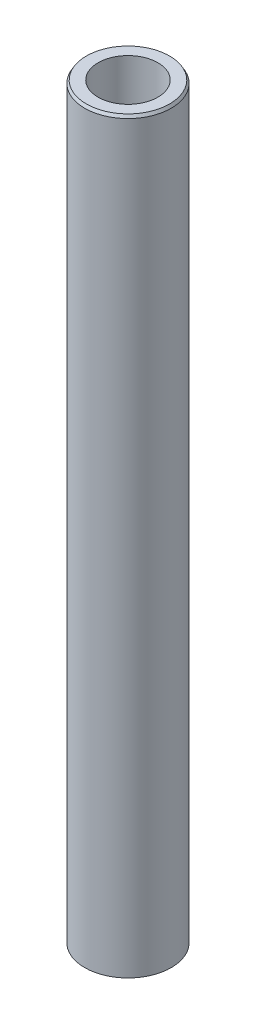
ISO-10303-21;
HEADER;
FILE_DESCRIPTION(('STEP AP214'),'2;1');
FILE_NAME('part.step','',(''),(''),'','','');
FILE_SCHEMA(('AUTOMOTIVE_DESIGN { 1 0 10303 214 1 1 1 1 }'));
ENDSEC;
DATA;
#1=APPLICATION_CONTEXT('core data for automotive mechanical design processes');
#2=APPLICATION_PROTOCOL_DEFINITION('international standard','automotive_design',2000,#1);
#3=PRODUCT_CONTEXT('',#1,'mechanical');
#4=PRODUCT('Part','Part','',(#3));
#5=PRODUCT_RELATED_PRODUCT_CATEGORY('part','',(#4));
#6=PRODUCT_DEFINITION_FORMATION('','',#4);
#7=PRODUCT_DEFINITION_CONTEXT('part definition',#1,'design');
#8=PRODUCT_DEFINITION('design','',#6,#7);
#9=PRODUCT_DEFINITION_SHAPE('','',#8);
#10=(LENGTH_UNIT() NAMED_UNIT(*) SI_UNIT(.MILLI.,.METRE.));
#11=(NAMED_UNIT(*) PLANE_ANGLE_UNIT() SI_UNIT($,.RADIAN.));
#12=(NAMED_UNIT(*) SI_UNIT($,.STERADIAN.) SOLID_ANGLE_UNIT());
#13=UNCERTAINTY_MEASURE_WITH_UNIT(LENGTH_MEASURE(1.E-05),#10,'distance_accuracy_value','');
#14=(GEOMETRIC_REPRESENTATION_CONTEXT(3) GLOBAL_UNCERTAINTY_ASSIGNED_CONTEXT((#13)) GLOBAL_UNIT_ASSIGNED_CONTEXT((#10,
#11,#12)) REPRESENTATION_CONTEXT('',''));
#15=CARTESIAN_POINT('',(0.,0.,0.));
#16=DIRECTION('',(0.,0.,1.));
#17=DIRECTION('',(1.,0.,0.));
#18=AXIS2_PLACEMENT_3D('',#15,#16,#17);
#19=CARTESIAN_POINT('',(0.,432.769714062109,0.));
#20=DIRECTION('',(0.,-1.,0.));
#21=DIRECTION('',(0.,0.,-1.));
#22=AXIS2_PLACEMENT_3D('',#19,#20,#21);
#23=CYLINDRICAL_SURFACE('',#22,25.);
#24=CARTESIAN_POINT('',(0.,431.106539177771,0.));
#25=DIRECTION('',(0.,1.,0.));
#26=DIRECTION('',(0.,0.,1.));
#27=AXIS2_PLACEMENT_3D('',#24,#25,#26);
#28=CIRCLE('',#27,25.);
#29=CARTESIAN_POINT('',(0.,431.106539177771,25.));
#30=VERTEX_POINT('',#29);
#31=EDGE_CURVE('E50',#30,#30,#28,.F.);
#32=ORIENTED_EDGE('',*,*,#31,.T.);
#33=EDGE_LOOP('',(#32));
#34=FACE_BOUND('',#33,.T.);
#35=CARTESIAN_POINT('',(0.,0.960234467181853,0.));
#36=DIRECTION('',(0.,1.,0.));
#37=DIRECTION('',(0.,0.,1.));
#38=AXIS2_PLACEMENT_3D('',#35,#36,#37);
#39=CIRCLE('',#38,25.);
#40=CARTESIAN_POINT('',(0.,0.960234467181853,25.));
#41=VERTEX_POINT('',#40);
#42=EDGE_CURVE('E51',#41,#41,#39,.T.);
#43=ORIENTED_EDGE('',*,*,#42,.T.);
#44=EDGE_LOOP('',(#43));
#45=FACE_BOUND('',#44,.T.);
#46=ADVANCED_FACE('F39',(#34,#45),#23,.T.);
#47=CARTESIAN_POINT('',(0.,432.769714062109,0.));
#48=DIRECTION('',(0.,1.,0.));
#49=DIRECTION('',(0.,0.,1.));
#50=AXIS2_PLACEMENT_3D('',#47,#48,#49);
#51=PLANE('',#50);
#52=CARTESIAN_POINT('',(0.,432.769714062109,0.));
#53=DIRECTION('',(0.,1.,0.));
#54=DIRECTION('',(0.,0.,1.));
#55=AXIS2_PLACEMENT_3D('',#52,#53,#54);
#56=CIRCLE('',#55,24.0397655328182);
#57=CARTESIAN_POINT('',(0.,432.769714062109,24.0397655328182));
#58=VERTEX_POINT('',#57);
#59=EDGE_CURVE('E54',#58,#58,#56,.T.);
#60=ORIENTED_EDGE('',*,*,#59,.T.);
#61=EDGE_LOOP('',(#60));
#62=FACE_BOUND('',#61,.T.);
#63=CARTESIAN_POINT('',(0.,432.769714062109,0.));
#64=DIRECTION('',(0.,1.,0.));
#65=DIRECTION('',(0.,0.,1.));
#66=AXIS2_PLACEMENT_3D('',#63,#64,#65);
#67=CIRCLE('',#66,17.277735565056);
#68=CARTESIAN_POINT('',(0.,432.769714062109,17.277735565056));
#69=VERTEX_POINT('',#68);
#70=EDGE_CURVE('E58',#69,#69,#67,.T.);
#71=ORIENTED_EDGE('',*,*,#70,.F.);
#72=EDGE_LOOP('',(#71));
#73=FACE_BOUND('',#72,.T.);
#74=ADVANCED_FACE('F69',(#62,#73),#51,.T.);
#75=CARTESIAN_POINT('',(0.,0.,0.));
#76=DIRECTION('',(0.,1.,0.));
#77=DIRECTION('',(0.,0.,1.));
#78=AXIS2_PLACEMENT_3D('',#75,#76,#77);
#79=PLANE('',#78);
#80=CARTESIAN_POINT('',(0.,0.,0.));
#81=DIRECTION('',(0.,1.,0.));
#82=DIRECTION('',(0.,0.,1.));
#83=AXIS2_PLACEMENT_3D('',#80,#81,#82);
#84=CIRCLE('',#83,23.3368251156622);
#85=CARTESIAN_POINT('',(0.,0.,23.3368251156622));
#86=VERTEX_POINT('',#85);
#87=EDGE_CURVE('E10',#86,#86,#84,.F.);
#88=ORIENTED_EDGE('',*,*,#87,.T.);
#89=EDGE_LOOP('',(#88));
#90=FACE_BOUND('',#89,.T.);
#91=CARTESIAN_POINT('',(0.,0.,0.));
#92=DIRECTION('',(0.,1.,0.));
#93=DIRECTION('',(0.,0.,1.));
#94=AXIS2_PLACEMENT_3D('',#91,#92,#93);
#95=CIRCLE('',#94,17.277735565056);
#96=CARTESIAN_POINT('',(0.,0.,17.277735565056));
#97=VERTEX_POINT('',#96);
#98=EDGE_CURVE('E63',#97,#97,#95,.T.);
#99=ORIENTED_EDGE('',*,*,#98,.T.);
#100=EDGE_LOOP('',(#99));
#101=FACE_BOUND('',#100,.T.);
#102=ADVANCED_FACE('F75',(#90,#101),#79,.F.);
#103=CARTESIAN_POINT('',(0.,432.769714062109,0.));
#104=DIRECTION('',(0.,-1.,0.));
#105=DIRECTION('',(0.,0.,-1.));
#106=AXIS2_PLACEMENT_3D('',#103,#104,#105);
#107=CYLINDRICAL_SURFACE('',#106,17.277735565056);
#108=ORIENTED_EDGE('',*,*,#70,.T.);
#109=EDGE_LOOP('',(#108));
#110=FACE_BOUND('',#109,.T.);
#111=ORIENTED_EDGE('',*,*,#98,.F.);
#112=EDGE_LOOP('',(#111));
#113=FACE_BOUND('',#112,.T.);
#114=ADVANCED_FACE('F70',(#110,#113),#107,.F.);
#115=CARTESIAN_POINT('',(0.,432.769714062109,0.));
#116=DIRECTION('',(0.,-1.,0.));
#117=DIRECTION('',(0.,0.,-1.));
#118=AXIS2_PLACEMENT_3D('',#115,#116,#117);
#119=CONICAL_SURFACE('',#118,24.0397655328182,0.523598775598285);
#120=ORIENTED_EDGE('',*,*,#31,.F.);
#121=EDGE_LOOP('',(#120));
#122=FACE_BOUND('',#121,.T.);
#123=ORIENTED_EDGE('',*,*,#59,.F.);
#124=EDGE_LOOP('',(#123));
#125=FACE_BOUND('',#124,.T.);
#126=ADVANCED_FACE('F81',(#122,#125),#119,.T.);
#127=CARTESIAN_POINT('',(0.,0.960234467181853,0.));
#128=DIRECTION('',(0.,1.,0.));
#129=DIRECTION('',(0.,0.,1.));
#130=AXIS2_PLACEMENT_3D('',#127,#128,#129);
#131=CONICAL_SURFACE('',#130,25.,1.0471975511966);
#132=CARTESIAN_POINT('',(0.,0.,23.3368251156622));
#133=CARTESIAN_POINT('',(0.,0.0100024423664783,23.3541498540407));
#134=CARTESIAN_POINT('',(0.,0.0200048847329557,23.3714745924192));
#135=CARTESIAN_POINT('',(0.,0.0400097694659104,23.4061240691763));
#136=CARTESIAN_POINT('',(0.,0.0500122118323878,23.4234488075548));
#137=CARTESIAN_POINT('',(0.,0.0700170965653431,23.4580982843118));
#138=CARTESIAN_POINT('',(0.,0.0800195389318209,23.4754230226904));
#139=CARTESIAN_POINT('',(0.,0.100024423664776,23.5100724994474));
#140=CARTESIAN_POINT('',(0.,0.110026866031254,23.5273972378259));
#141=CARTESIAN_POINT('',(0.,0.130031750764209,23.5620467145829));
#142=CARTESIAN_POINT('',(0.,0.140034193130687,23.5793714529615));
#143=CARTESIAN_POINT('',(0.,0.160039077863642,23.6140209297185));
#144=CARTESIAN_POINT('',(0.,0.17004152023012,23.631345668097));
#145=CARTESIAN_POINT('',(0.,0.190046404963075,23.6659951448541));
#146=CARTESIAN_POINT('',(0.,0.200048847329552,23.6833198832326));
#147=CARTESIAN_POINT('',(0.,0.220053732062508,23.7179693599896));
#148=CARTESIAN_POINT('',(0.,0.230056174428986,23.7352940983681));
#149=CARTESIAN_POINT('',(0.,0.250061059161941,23.7699435751252));
#150=CARTESIAN_POINT('',(0.,0.260063501528418,23.7872683135037));
#151=CARTESIAN_POINT('',(0.,0.280068386261373,23.8219177902607));
#152=CARTESIAN_POINT('',(0.,0.290070828627851,23.8392425286393));
#153=CARTESIAN_POINT('',(0.,0.310075713360807,23.8738920053963));
#154=CARTESIAN_POINT('',(0.,0.320078155727285,23.8912167437748));
#155=CARTESIAN_POINT('',(0.,0.34008304046024,23.9258662205318));
#156=CARTESIAN_POINT('',(0.,0.350085482826717,23.9431909589104));
#157=CARTESIAN_POINT('',(0.,0.370090367559672,23.9778404356674));
#158=CARTESIAN_POINT('',(0.,0.38009280992615,23.9951651740459));
#159=CARTESIAN_POINT('',(0.,0.400097694659105,24.029814650803));
#160=CARTESIAN_POINT('',(0.,0.410100137025583,24.0471393891815));
#161=CARTESIAN_POINT('',(0.,0.430105021758538,24.0817888659385));
#162=CARTESIAN_POINT('',(0.,0.440107464125016,24.099113604317));
#163=CARTESIAN_POINT('',(0.,0.460112348857971,24.1337630810741));
#164=CARTESIAN_POINT('',(0.,0.470114791224449,24.1510878194526));
#165=CARTESIAN_POINT('',(0.,0.490119675957404,24.1857372962096));
#166=CARTESIAN_POINT('',(0.,0.500122118323882,24.2030620345881));
#167=CARTESIAN_POINT('',(0.,0.520127003056837,24.2377115113452));
#168=CARTESIAN_POINT('',(0.,0.530129445423315,24.2550362497237));
#169=CARTESIAN_POINT('',(0.,0.55013433015627,24.2896857264807));
#170=CARTESIAN_POINT('',(0.,0.560136772522747,24.3070104648593));
#171=CARTESIAN_POINT('',(0.,0.580141657255703,24.3416599416163));
#172=CARTESIAN_POINT('',(0.,0.590144099622181,24.3589846799948));
#173=CARTESIAN_POINT('',(0.,0.610148984355136,24.3936341567518));
#174=CARTESIAN_POINT('',(0.,0.620151426721613,24.4109588951304));
#175=CARTESIAN_POINT('',(0.,0.640156311454568,24.4456083718874));
#176=CARTESIAN_POINT('',(0.,0.650158753821046,24.4629331102659));
#177=CARTESIAN_POINT('',(0.,0.670163638554002,24.497582587023));
#178=CARTESIAN_POINT('',(0.,0.680166080920479,24.5149073254015));
#179=CARTESIAN_POINT('',(0.,0.700170965653435,24.5495568021585));
#180=CARTESIAN_POINT('',(0.,0.710173408019912,24.566881540537));
#181=CARTESIAN_POINT('',(0.,0.730178292752867,24.6015310172941));
#182=CARTESIAN_POINT('',(0.,0.740180735119345,24.6188557556726));
#183=CARTESIAN_POINT('',(0.,0.7601856198523,24.6535052324296));
#184=CARTESIAN_POINT('',(0.,0.770188062218778,24.6708299708081));
#185=CARTESIAN_POINT('',(0.,0.790192946951733,24.7054794475652));
#186=CARTESIAN_POINT('',(0.,0.800195389318211,24.7228041859437));
#187=CARTESIAN_POINT('',(0.,0.820200274051166,24.7574536627007));
#188=CARTESIAN_POINT('',(0.,0.830202716417643,24.7747784010793));
#189=CARTESIAN_POINT('',(0.,0.850207601150599,24.8094278778363));
#190=CARTESIAN_POINT('',(0.,0.860210043517076,24.8267526162148));
#191=CARTESIAN_POINT('',(0.,0.880214928250032,24.8614020929719));
#192=CARTESIAN_POINT('',(0.,0.89021737061651,24.8787268313504));
#193=CARTESIAN_POINT('',(0.,0.910222255349465,24.9133763081074));
#194=CARTESIAN_POINT('',(0.,0.920224697715942,24.9307010464859));
#195=CARTESIAN_POINT('',(0.,0.940229582448897,24.965350523243));
#196=CARTESIAN_POINT('',(0.,0.950232024815374,24.9826752616215));
#197=CARTESIAN_POINT('',(0.,0.960234467181853,25.));
#198=B_SPLINE_CURVE_WITH_KNOTS('',3,(#132,#133,#134,#135,#136,#137,#138,#139,#140,#141,#142,
#143,#144,#145,#146,#147,#148,#149,#150,#151,#152,#153,#154,#155,#156,#157,#158,#159,#160,#161,
#162,#163,#164,#165,#166,#167,#168,#169,#170,#171,#172,#173,#174,#175,#176,#177,#178,#179,#180,
#181,#182,#183,#184,#185,#186,#187,#188,#189,#190,#191,#192,#193,#194,#195,#196,#197),
.UNSPECIFIED.,.F.,.F.,(4,2,2,2,2,2,2,2,2,2,2,2,2,2,2,2,2,2,2,2,2,2,2,2,2,2,2,2,2,2,2,2,4),(0.,
0.0600146541988647,0.120029308397732,0.180043962596597,0.240058616795462,0.300073270994327,
0.360087925193194,0.420102579392059,0.480117233590924,0.540131887789792,0.600146541988656,
0.660161196187521,0.720175850386389,0.780190504585254,0.840205158784118,0.900219812982986,
0.960234467181851,1.02024912138072,1.08026377557958,1.14027842977845,1.20029308397731,
1.26030773817618,1.32032239237505,1.38033704657391,1.44035170077277,1.50036635497164,
1.56038100917051,1.62039566336937,1.68041031756824,1.7404249717671,1.80043962596597,
1.86045428016484,1.9204689343637),.UNSPECIFIED.);
#199=EDGE_CURVE('BSEAM45',#86,#41,#198,.T.);
#200=ORIENTED_EDGE('',*,*,#87,.F.);
#201=ORIENTED_EDGE('',*,*,#42,.F.);
#202=ORIENTED_EDGE('',*,*,#199,.T.);
#203=ORIENTED_EDGE('',*,*,#199,.F.);
#204=EDGE_LOOP('',(#200,#202,#201,#203));
#205=FACE_BOUND('',#204,.T.);
#206=ADVANCED_FACE('F45',(#205),#131,.T.);
#207=CLOSED_SHELL('',(#46,#74,#102,#114,#126,#206));
#208=MANIFOLD_SOLID_BREP('B2',#207);
#209=ADVANCED_BREP_SHAPE_REPRESENTATION('',(#18,#208),#14);
#210=SHAPE_DEFINITION_REPRESENTATION(#9,#209);
ENDSEC;
END-ISO-10303-21;
